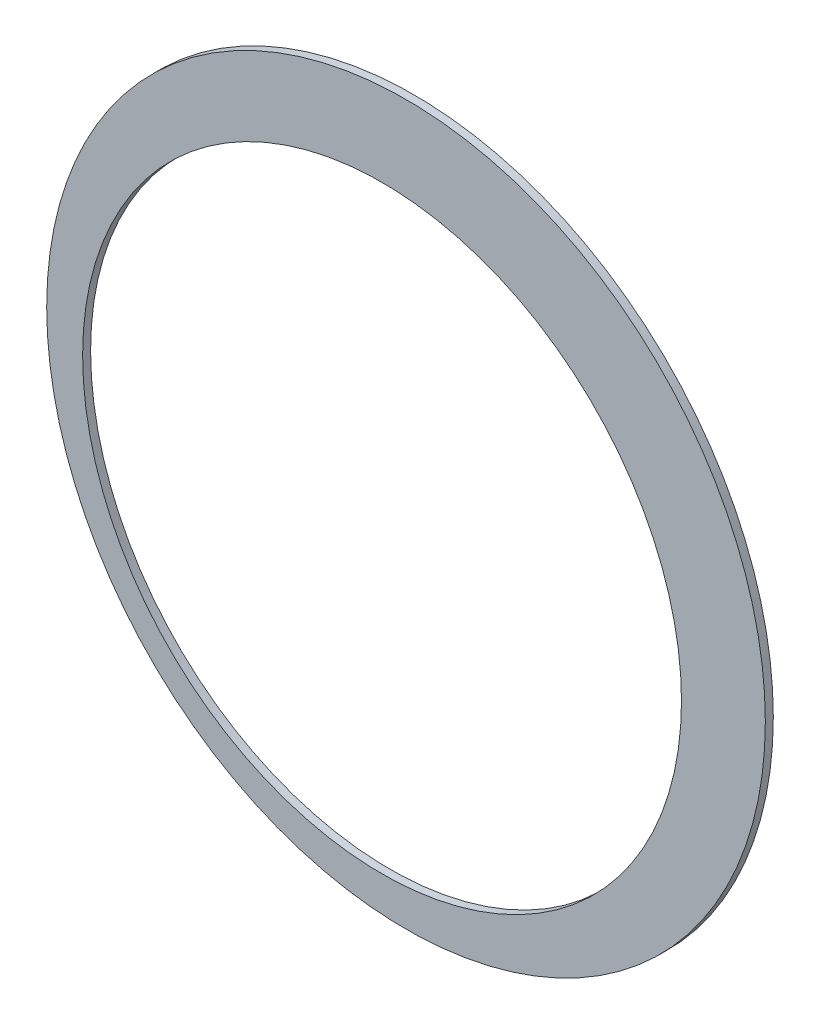
ISO-10303-21;
HEADER;
FILE_DESCRIPTION(('STEP AP214'),'2;1');
FILE_NAME('part.step','',(''),(''),'','','');
FILE_SCHEMA(('AUTOMOTIVE_DESIGN { 1 0 10303 214 1 1 1 1 }'));
ENDSEC;
DATA;
#1=APPLICATION_CONTEXT('core data for automotive mechanical design processes');
#2=APPLICATION_PROTOCOL_DEFINITION('international standard','automotive_design',2000,#1);
#3=PRODUCT_CONTEXT('',#1,'mechanical');
#4=PRODUCT('Part','Part','',(#3));
#5=PRODUCT_RELATED_PRODUCT_CATEGORY('part','',(#4));
#6=PRODUCT_DEFINITION_FORMATION('','',#4);
#7=PRODUCT_DEFINITION_CONTEXT('part definition',#1,'design');
#8=PRODUCT_DEFINITION('design','',#6,#7);
#9=PRODUCT_DEFINITION_SHAPE('','',#8);
#10=(LENGTH_UNIT() NAMED_UNIT(*) SI_UNIT(.MILLI.,.METRE.));
#11=(NAMED_UNIT(*) PLANE_ANGLE_UNIT() SI_UNIT($,.RADIAN.));
#12=(NAMED_UNIT(*) SI_UNIT($,.STERADIAN.) SOLID_ANGLE_UNIT());
#13=UNCERTAINTY_MEASURE_WITH_UNIT(LENGTH_MEASURE(1.E-05),#10,'distance_accuracy_value','');
#14=(GEOMETRIC_REPRESENTATION_CONTEXT(3) GLOBAL_UNCERTAINTY_ASSIGNED_CONTEXT((#13)) GLOBAL_UNIT_ASSIGNED_CONTEXT((#10,
#11,#12)) REPRESENTATION_CONTEXT('',''));
#15=CARTESIAN_POINT('',(0.,0.,0.));
#16=DIRECTION('',(0.,0.,1.));
#17=DIRECTION('',(1.,0.,0.));
#18=AXIS2_PLACEMENT_3D('',#15,#16,#17);
#19=CARTESIAN_POINT('',(3.,3.,1.));
#20=DIRECTION('',(0.,0.,1.));
#21=DIRECTION('',(1.,0.,0.));
#22=AXIS2_PLACEMENT_3D('',#19,#20,#21);
#23=PLANE('',#22);
#24=CARTESIAN_POINT('',(3.,3.,1.));
#25=DIRECTION('',(0.,0.,1.));
#26=DIRECTION('',(1.,0.,0.));
#27=AXIS2_PLACEMENT_3D('',#24,#25,#26);
#28=CIRCLE('',#27,45.);
#29=CARTESIAN_POINT('',(48.,3.,1.));
#30=VERTEX_POINT('',#29);
#31=EDGE_CURVE('E10',#30,#30,#28,.T.);
#32=ORIENTED_EDGE('',*,*,#31,.T.);
#33=EDGE_LOOP('',(#32));
#34=FACE_BOUND('',#33,.T.);
#35=CARTESIAN_POINT('',(0.,0.,1.));
#36=DIRECTION('',(0.,0.,1.));
#37=DIRECTION('',(1.,0.,0.));
#38=AXIS2_PLACEMENT_3D('',#35,#36,#37);
#39=CIRCLE('',#38,37.5);
#40=CARTESIAN_POINT('',(37.5,0.,1.));
#41=VERTEX_POINT('',#40);
#42=EDGE_CURVE('E33',#41,#41,#39,.T.);
#43=ORIENTED_EDGE('',*,*,#42,.F.);
#44=EDGE_LOOP('',(#43));
#45=FACE_BOUND('',#44,.T.);
#46=ADVANCED_FACE('F22',(#34,#45),#23,.T.);
#47=CARTESIAN_POINT('',(3.,3.,0.));
#48=DIRECTION('',(0.,0.,1.));
#49=DIRECTION('',(1.,0.,0.));
#50=AXIS2_PLACEMENT_3D('',#47,#48,#49);
#51=PLANE('',#50);
#52=CARTESIAN_POINT('',(3.,3.,0.));
#53=DIRECTION('',(0.,0.,1.));
#54=DIRECTION('',(1.,0.,0.));
#55=AXIS2_PLACEMENT_3D('',#52,#53,#54);
#56=CIRCLE('',#55,45.);
#57=CARTESIAN_POINT('',(48.,3.,0.));
#58=VERTEX_POINT('',#57);
#59=EDGE_CURVE('E29',#58,#58,#56,.T.);
#60=ORIENTED_EDGE('',*,*,#59,.F.);
#61=EDGE_LOOP('',(#60));
#62=FACE_BOUND('',#61,.T.);
#63=CARTESIAN_POINT('',(0.,0.,0.));
#64=DIRECTION('',(0.,0.,1.));
#65=DIRECTION('',(1.,0.,0.));
#66=AXIS2_PLACEMENT_3D('',#63,#64,#65);
#67=CIRCLE('',#66,37.5);
#68=CARTESIAN_POINT('',(37.5,0.,0.));
#69=VERTEX_POINT('',#68);
#70=EDGE_CURVE('E37',#69,#69,#67,.T.);
#71=ORIENTED_EDGE('',*,*,#70,.T.);
#72=EDGE_LOOP('',(#71));
#73=FACE_BOUND('',#72,.T.);
#74=ADVANCED_FACE('F43',(#62,#73),#51,.F.);
#75=CARTESIAN_POINT('',(3.,3.,1.));
#76=DIRECTION('',(0.,0.,-1.));
#77=DIRECTION('',(-1.,0.,0.));
#78=AXIS2_PLACEMENT_3D('',#75,#76,#77);
#79=CYLINDRICAL_SURFACE('',#78,45.);
#80=ORIENTED_EDGE('',*,*,#31,.F.);
#81=EDGE_LOOP('',(#80));
#82=FACE_BOUND('',#81,.T.);
#83=ORIENTED_EDGE('',*,*,#59,.T.);
#84=EDGE_LOOP('',(#83));
#85=FACE_BOUND('',#84,.T.);
#86=ADVANCED_FACE('F24',(#82,#85),#79,.T.);
#87=CARTESIAN_POINT('',(0.,0.,1.));
#88=DIRECTION('',(0.,0.,-1.));
#89=DIRECTION('',(-1.,0.,0.));
#90=AXIS2_PLACEMENT_3D('',#87,#88,#89);
#91=CYLINDRICAL_SURFACE('',#90,37.5);
#92=ORIENTED_EDGE('',*,*,#42,.T.);
#93=EDGE_LOOP('',(#92));
#94=FACE_BOUND('',#93,.T.);
#95=ORIENTED_EDGE('',*,*,#70,.F.);
#96=EDGE_LOOP('',(#95));
#97=FACE_BOUND('',#96,.T.);
#98=ADVANCED_FACE('F45',(#94,#97),#91,.F.);
#99=CLOSED_SHELL('',(#46,#74,#86,#98));
#100=MANIFOLD_SOLID_BREP('B2',#99);
#101=ADVANCED_BREP_SHAPE_REPRESENTATION('',(#18,#100),#14);
#102=SHAPE_DEFINITION_REPRESENTATION(#9,#101);
ENDSEC;
END-ISO-10303-21;
